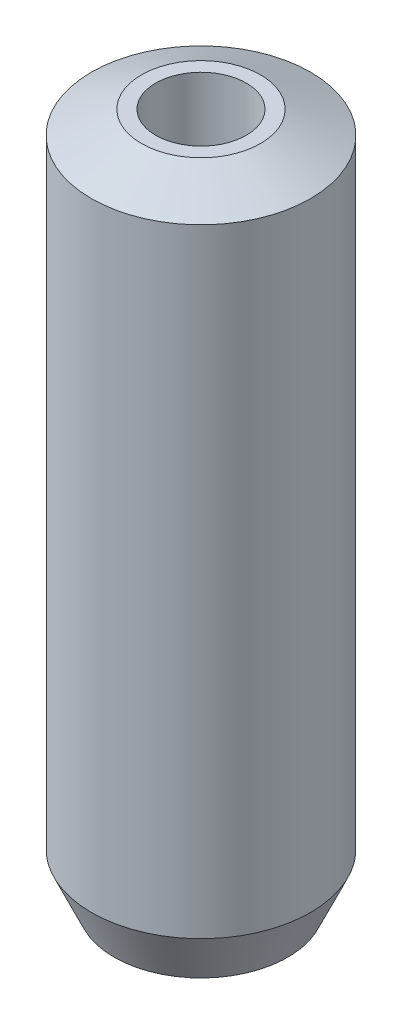
ISO-10303-21;
HEADER;
FILE_DESCRIPTION(('STEP AP214'),'2;1');
FILE_NAME('part.step','',(''),(''),'','','');
FILE_SCHEMA(('AUTOMOTIVE_DESIGN { 1 0 10303 214 1 1 1 1 }'));
ENDSEC;
DATA;
#1=APPLICATION_CONTEXT('core data for automotive mechanical design processes');
#2=APPLICATION_PROTOCOL_DEFINITION('international standard','automotive_design',2000,#1);
#3=PRODUCT_CONTEXT('',#1,'mechanical');
#4=PRODUCT('Part','Part','',(#3));
#5=PRODUCT_RELATED_PRODUCT_CATEGORY('part','',(#4));
#6=PRODUCT_DEFINITION_FORMATION('','',#4);
#7=PRODUCT_DEFINITION_CONTEXT('part definition',#1,'design');
#8=PRODUCT_DEFINITION('design','',#6,#7);
#9=PRODUCT_DEFINITION_SHAPE('','',#8);
#10=(LENGTH_UNIT() NAMED_UNIT(*) SI_UNIT(.MILLI.,.METRE.));
#11=(NAMED_UNIT(*) PLANE_ANGLE_UNIT() SI_UNIT($,.RADIAN.));
#12=(NAMED_UNIT(*) SI_UNIT($,.STERADIAN.) SOLID_ANGLE_UNIT());
#13=UNCERTAINTY_MEASURE_WITH_UNIT(LENGTH_MEASURE(1.E-05),#10,'distance_accuracy_value','');
#14=(GEOMETRIC_REPRESENTATION_CONTEXT(3) GLOBAL_UNCERTAINTY_ASSIGNED_CONTEXT((#13)) GLOBAL_UNIT_ASSIGNED_CONTEXT((#10,
#11,#12)) REPRESENTATION_CONTEXT('',''));
#15=CARTESIAN_POINT('',(0.,0.,0.));
#16=DIRECTION('',(0.,0.,1.));
#17=DIRECTION('',(1.,0.,0.));
#18=AXIS2_PLACEMENT_3D('',#15,#16,#17);
#19=CARTESIAN_POINT('',(0.,94.5936581526738,0.));
#20=DIRECTION('',(0.,-1.,0.));
#21=DIRECTION('',(0.,0.,-1.));
#22=AXIS2_PLACEMENT_3D('',#19,#20,#21);
#23=CYLINDRICAL_SURFACE('',#22,15.);
#24=CARTESIAN_POINT('',(0.,91.4923966525902,0.));
#25=DIRECTION('',(0.,1.,0.));
#26=DIRECTION('',(0.,0.,1.));
#27=AXIS2_PLACEMENT_3D('',#24,#25,#26);
#28=CIRCLE('',#27,15.);
#29=CARTESIAN_POINT('',(0.,91.4923966525902,15.));
#30=VERTEX_POINT('',#29);
#31=EDGE_CURVE('E50',#30,#30,#28,.F.);
#32=ORIENTED_EDGE('',*,*,#31,.T.);
#33=EDGE_LOOP('',(#32));
#34=FACE_BOUND('',#33,.T.);
#35=CARTESIAN_POINT('',(0.,6.85184854728246,0.));
#36=DIRECTION('',(0.,1.,0.));
#37=DIRECTION('',(0.,0.,1.));
#38=AXIS2_PLACEMENT_3D('',#35,#36,#37);
#39=CIRCLE('',#38,15.);
#40=CARTESIAN_POINT('',(0.,6.85184854728246,15.));
#41=VERTEX_POINT('',#40);
#42=EDGE_CURVE('E51',#41,#41,#39,.T.);
#43=ORIENTED_EDGE('',*,*,#42,.T.);
#44=EDGE_LOOP('',(#43));
#45=FACE_BOUND('',#44,.T.);
#46=ADVANCED_FACE('F39',(#34,#45),#23,.T.);
#47=CARTESIAN_POINT('',(0.,94.5936581526738,0.));
#48=DIRECTION('',(0.,1.,0.));
#49=DIRECTION('',(0.,0.,1.));
#50=AXIS2_PLACEMENT_3D('',#47,#48,#49);
#51=PLANE('',#50);
#52=CARTESIAN_POINT('',(0.,94.5936581526738,0.));
#53=DIRECTION('',(0.,1.,0.));
#54=DIRECTION('',(0.,0.,1.));
#55=AXIS2_PLACEMENT_3D('',#52,#53,#54);
#56=CIRCLE('',#55,8.14815145271754);
#57=CARTESIAN_POINT('',(0.,94.5936581526738,8.14815145271754));
#58=VERTEX_POINT('',#57);
#59=EDGE_CURVE('E54',#58,#58,#56,.T.);
#60=ORIENTED_EDGE('',*,*,#59,.T.);
#61=EDGE_LOOP('',(#60));
#62=FACE_BOUND('',#61,.T.);
#63=CARTESIAN_POINT('',(0.,94.5936581526738,0.));
#64=DIRECTION('',(0.,1.,0.));
#65=DIRECTION('',(0.,0.,1.));
#66=AXIS2_PLACEMENT_3D('',#63,#64,#65);
#67=CIRCLE('',#66,6.19863884740345);
#68=CARTESIAN_POINT('',(0.,94.5936581526738,6.19863884740345));
#69=VERTEX_POINT('',#68);
#70=EDGE_CURVE('E58',#69,#69,#67,.T.);
#71=ORIENTED_EDGE('',*,*,#70,.F.);
#72=EDGE_LOOP('',(#71));
#73=FACE_BOUND('',#72,.T.);
#74=ADVANCED_FACE('F69',(#62,#73),#51,.T.);
#75=CARTESIAN_POINT('',(0.,0.,0.));
#76=DIRECTION('',(0.,1.,0.));
#77=DIRECTION('',(0.,0.,1.));
#78=AXIS2_PLACEMENT_3D('',#75,#76,#77);
#79=PLANE('',#78);
#80=CARTESIAN_POINT('',(0.,0.,0.));
#81=DIRECTION('',(0.,1.,0.));
#82=DIRECTION('',(0.,0.,1.));
#83=AXIS2_PLACEMENT_3D('',#80,#81,#82);
#84=CIRCLE('',#83,11.8987384999163);
#85=CARTESIAN_POINT('',(0.,0.,11.8987384999163));
#86=VERTEX_POINT('',#85);
#87=EDGE_CURVE('E10',#86,#86,#84,.F.);
#88=ORIENTED_EDGE('',*,*,#87,.T.);
#89=EDGE_LOOP('',(#88));
#90=FACE_BOUND('',#89,.T.);
#91=CARTESIAN_POINT('',(0.,0.,0.));
#92=DIRECTION('',(0.,1.,0.));
#93=DIRECTION('',(0.,0.,1.));
#94=AXIS2_PLACEMENT_3D('',#91,#92,#93);
#95=CIRCLE('',#94,6.19863884740345);
#96=CARTESIAN_POINT('',(0.,0.,6.19863884740345));
#97=VERTEX_POINT('',#96);
#98=EDGE_CURVE('E63',#97,#97,#95,.T.);
#99=ORIENTED_EDGE('',*,*,#98,.T.);
#100=EDGE_LOOP('',(#99));
#101=FACE_BOUND('',#100,.T.);
#102=ADVANCED_FACE('F75',(#90,#101),#79,.F.);
#103=CARTESIAN_POINT('',(0.,94.5936581526738,0.));
#104=DIRECTION('',(0.,-1.,0.));
#105=DIRECTION('',(0.,0.,-1.));
#106=AXIS2_PLACEMENT_3D('',#103,#104,#105);
#107=CYLINDRICAL_SURFACE('',#106,6.19863884740345);
#108=ORIENTED_EDGE('',*,*,#70,.T.);
#109=EDGE_LOOP('',(#108));
#110=FACE_BOUND('',#109,.T.);
#111=ORIENTED_EDGE('',*,*,#98,.F.);
#112=EDGE_LOOP('',(#111));
#113=FACE_BOUND('',#112,.T.);
#114=ADVANCED_FACE('F70',(#110,#113),#107,.F.);
#115=CARTESIAN_POINT('',(0.,94.5936581526738,0.));
#116=DIRECTION('',(0.,-1.,0.));
#117=DIRECTION('',(0.,0.,-1.));
#118=AXIS2_PLACEMENT_3D('',#115,#116,#117);
#119=CONICAL_SURFACE('',#118,8.14815145271754,1.14576843186043);
#120=ORIENTED_EDGE('',*,*,#31,.F.);
#121=EDGE_LOOP('',(#120));
#122=FACE_BOUND('',#121,.T.);
#123=ORIENTED_EDGE('',*,*,#59,.F.);
#124=EDGE_LOOP('',(#123));
#125=FACE_BOUND('',#124,.T.);
#126=ADVANCED_FACE('F81',(#122,#125),#119,.T.);
#127=CARTESIAN_POINT('',(0.,6.85184854728246,0.));
#128=DIRECTION('',(0.,1.,0.));
#129=DIRECTION('',(0.,0.,1.));
#130=AXIS2_PLACEMENT_3D('',#127,#128,#129);
#131=CONICAL_SURFACE('',#130,15.,0.425027894934466);
#132=ORIENTED_EDGE('',*,*,#87,.F.);
#133=EDGE_LOOP('',(#132));
#134=FACE_BOUND('',#133,.T.);
#135=ORIENTED_EDGE('',*,*,#42,.F.);
#136=EDGE_LOOP('',(#135));
#137=FACE_BOUND('',#136,.T.);
#138=ADVANCED_FACE('F45',(#134,#137),#131,.T.);
#139=CLOSED_SHELL('',(#46,#74,#102,#114,#126,#138));
#140=MANIFOLD_SOLID_BREP('B2',#139);
#141=ADVANCED_BREP_SHAPE_REPRESENTATION('',(#18,#140),#14);
#142=SHAPE_DEFINITION_REPRESENTATION(#9,#141);
ENDSEC;
END-ISO-10303-21;
